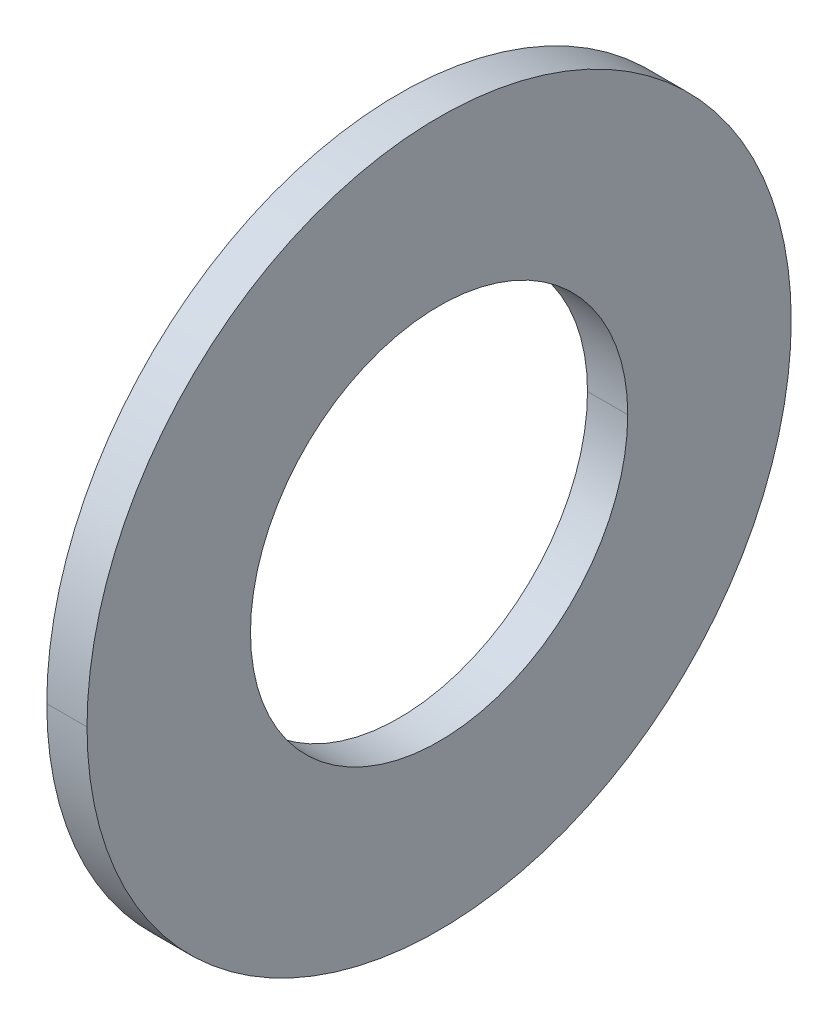
ISO-10303-21;
HEADER;
FILE_DESCRIPTION(('STEP AP214'),'2;1');
FILE_NAME('part.step','',(''),(''),'','','');
FILE_SCHEMA(('AUTOMOTIVE_DESIGN { 1 0 10303 214 1 1 1 1 }'));
ENDSEC;
DATA;
#1=APPLICATION_CONTEXT('core data for automotive mechanical design processes');
#2=APPLICATION_PROTOCOL_DEFINITION('international standard','automotive_design',2000,#1);
#3=PRODUCT_CONTEXT('',#1,'mechanical');
#4=PRODUCT('Part','Part','',(#3));
#5=PRODUCT_RELATED_PRODUCT_CATEGORY('part','',(#4));
#6=PRODUCT_DEFINITION_FORMATION('','',#4);
#7=PRODUCT_DEFINITION_CONTEXT('part definition',#1,'design');
#8=PRODUCT_DEFINITION('design','',#6,#7);
#9=PRODUCT_DEFINITION_SHAPE('','',#8);
#10=(LENGTH_UNIT() NAMED_UNIT(*) SI_UNIT(.MILLI.,.METRE.));
#11=(NAMED_UNIT(*) PLANE_ANGLE_UNIT() SI_UNIT($,.RADIAN.));
#12=(NAMED_UNIT(*) SI_UNIT($,.STERADIAN.) SOLID_ANGLE_UNIT());
#13=UNCERTAINTY_MEASURE_WITH_UNIT(LENGTH_MEASURE(1.E-05),#10,'distance_accuracy_value','');
#14=(GEOMETRIC_REPRESENTATION_CONTEXT(3) GLOBAL_UNCERTAINTY_ASSIGNED_CONTEXT((#13)) GLOBAL_UNIT_ASSIGNED_CONTEXT((#10,
#11,#12)) REPRESENTATION_CONTEXT('',''));
#15=CARTESIAN_POINT('',(0.,0.,0.));
#16=DIRECTION('',(0.,0.,1.));
#17=DIRECTION('',(1.,0.,0.));
#18=AXIS2_PLACEMENT_3D('',#15,#16,#17);
#19=CARTESIAN_POINT('',(0.8,0.,0.));
#20=DIRECTION('',(-1.,0.,0.));
#21=DIRECTION('',(0.,1.,0.));
#22=AXIS2_PLACEMENT_3D('',#19,#20,#21);
#23=CYLINDRICAL_SURFACE('',#22,7.5);
#24=DIRECTION('',(-1.,0.,0.));
#25=VECTOR('',#24,1.);
#26=CARTESIAN_POINT('',(0.8,0.,-7.5));
#27=LINE('',#26,#25);
#28=CARTESIAN_POINT('',(0.8,0.,-7.5));
#29=VERTEX_POINT('',#28);
#30=CARTESIAN_POINT('',(-0.8,0.,-7.5));
#31=VERTEX_POINT('',#30);
#32=EDGE_CURVE('E11',#29,#31,#27,.T.);
#33=ORIENTED_EDGE('',*,*,#32,.T.);
#34=CARTESIAN_POINT('',(-0.8,0.,0.));
#35=DIRECTION('',(1.,0.,0.));
#36=DIRECTION('',(0.,0.,-1.));
#37=AXIS2_PLACEMENT_3D('',#34,#35,#36);
#38=CIRCLE('',#37,7.5);
#39=CARTESIAN_POINT('',(-0.8,0.,7.5));
#40=VERTEX_POINT('',#39);
#41=EDGE_CURVE('E24',#40,#31,#38,.T.);
#42=ORIENTED_EDGE('',*,*,#41,.F.);
#43=DIRECTION('',(-1.,0.,0.));
#44=VECTOR('',#43,1.);
#45=CARTESIAN_POINT('',(0.8,0.,7.5));
#46=LINE('',#45,#44);
#47=CARTESIAN_POINT('',(0.8,0.,7.5));
#48=VERTEX_POINT('',#47);
#49=EDGE_CURVE('E93',#48,#40,#46,.T.);
#50=ORIENTED_EDGE('',*,*,#49,.F.);
#51=CARTESIAN_POINT('',(0.8,0.,0.));
#52=DIRECTION('',(1.,0.,0.));
#53=DIRECTION('',(0.,0.,-1.));
#54=AXIS2_PLACEMENT_3D('',#51,#52,#53);
#55=CIRCLE('',#54,7.5);
#56=EDGE_CURVE('E89',#48,#29,#55,.T.);
#57=ORIENTED_EDGE('',*,*,#56,.T.);
#58=EDGE_LOOP('',(#33,#42,#50,#57));
#59=FACE_BOUND('',#58,.T.);
#60=ADVANCED_FACE('F16',(#59),#23,.F.);
#61=CARTESIAN_POINT('',(0.8,0.,0.));
#62=DIRECTION('',(1.,0.,0.));
#63=DIRECTION('',(0.,0.,-1.));
#64=AXIS2_PLACEMENT_3D('',#61,#62,#63);
#65=PLANE('',#64);
#66=ORIENTED_EDGE('',*,*,#56,.F.);
#67=CARTESIAN_POINT('',(0.8,0.,0.));
#68=DIRECTION('',(1.,0.,0.));
#69=DIRECTION('',(0.,0.,-1.));
#70=AXIS2_PLACEMENT_3D('',#67,#68,#69);
#71=CIRCLE('',#70,7.5);
#72=EDGE_CURVE('E84',#29,#48,#71,.T.);
#73=ORIENTED_EDGE('',*,*,#72,.F.);
#74=EDGE_LOOP('',(#66,#73));
#75=FACE_BOUND('',#74,.T.);
#76=CARTESIAN_POINT('',(0.8,0.,0.));
#77=DIRECTION('',(1.,0.,0.));
#78=DIRECTION('',(0.,0.,-1.));
#79=AXIS2_PLACEMENT_3D('',#76,#77,#78);
#80=CIRCLE('',#79,14.);
#81=CARTESIAN_POINT('',(0.8,0.,-14.));
#82=VERTEX_POINT('',#81);
#83=CARTESIAN_POINT('',(0.8,0.,14.));
#84=VERTEX_POINT('',#83);
#85=EDGE_CURVE('E71',#82,#84,#80,.T.);
#86=ORIENTED_EDGE('',*,*,#85,.T.);
#87=CARTESIAN_POINT('',(0.8,0.,0.));
#88=DIRECTION('',(1.,0.,0.));
#89=DIRECTION('',(0.,0.,-1.));
#90=AXIS2_PLACEMENT_3D('',#87,#88,#89);
#91=CIRCLE('',#90,14.);
#92=EDGE_CURVE('E72',#84,#82,#91,.T.);
#93=ORIENTED_EDGE('',*,*,#92,.T.);
#94=EDGE_LOOP('',(#86,#93));
#95=FACE_BOUND('',#94,.T.);
#96=ADVANCED_FACE('F115',(#75,#95),#65,.T.);
#97=CARTESIAN_POINT('',(0.8,0.,0.));
#98=DIRECTION('',(-1.,0.,0.));
#99=DIRECTION('',(0.,1.,0.));
#100=AXIS2_PLACEMENT_3D('',#97,#98,#99);
#101=CYLINDRICAL_SURFACE('',#100,14.);
#102=DIRECTION('',(-1.,0.,0.));
#103=VECTOR('',#102,1.);
#104=CARTESIAN_POINT('',(0.8,0.,-14.));
#105=LINE('',#104,#103);
#106=CARTESIAN_POINT('',(-0.8,0.,-14.));
#107=VERTEX_POINT('',#106);
#108=EDGE_CURVE('E58',#82,#107,#105,.T.);
#109=ORIENTED_EDGE('',*,*,#108,.F.);
#110=ORIENTED_EDGE('',*,*,#92,.F.);
#111=DIRECTION('',(-1.,0.,0.));
#112=VECTOR('',#111,1.);
#113=CARTESIAN_POINT('',(0.8,0.,14.));
#114=LINE('',#113,#112);
#115=CARTESIAN_POINT('',(-0.8,0.,14.));
#116=VERTEX_POINT('',#115);
#117=EDGE_CURVE('E60',#84,#116,#114,.T.);
#118=ORIENTED_EDGE('',*,*,#117,.T.);
#119=CARTESIAN_POINT('',(-0.8,0.,0.));
#120=DIRECTION('',(1.,0.,0.));
#121=DIRECTION('',(0.,0.,-1.));
#122=AXIS2_PLACEMENT_3D('',#119,#120,#121);
#123=CIRCLE('',#122,14.);
#124=EDGE_CURVE('E53',#116,#107,#123,.T.);
#125=ORIENTED_EDGE('',*,*,#124,.T.);
#126=EDGE_LOOP('',(#109,#110,#118,#125));
#127=FACE_BOUND('',#126,.T.);
#128=ADVANCED_FACE('F55',(#127),#101,.T.);
#129=CARTESIAN_POINT('',(-0.8,0.,0.));
#130=DIRECTION('',(1.,0.,0.));
#131=DIRECTION('',(0.,0.,-1.));
#132=AXIS2_PLACEMENT_3D('',#129,#130,#131);
#133=PLANE('',#132);
#134=CARTESIAN_POINT('',(-0.8,0.,0.));
#135=DIRECTION('',(1.,0.,0.));
#136=DIRECTION('',(0.,0.,-1.));
#137=AXIS2_PLACEMENT_3D('',#134,#135,#136);
#138=CIRCLE('',#137,7.5);
#139=EDGE_CURVE('E63',#31,#40,#138,.T.);
#140=ORIENTED_EDGE('',*,*,#139,.T.);
#141=ORIENTED_EDGE('',*,*,#41,.T.);
#142=EDGE_LOOP('',(#140,#141));
#143=FACE_BOUND('',#142,.T.);
#144=ORIENTED_EDGE('',*,*,#124,.F.);
#145=CARTESIAN_POINT('',(-0.8,0.,0.));
#146=DIRECTION('',(1.,0.,0.));
#147=DIRECTION('',(0.,0.,-1.));
#148=AXIS2_PLACEMENT_3D('',#145,#146,#147);
#149=CIRCLE('',#148,14.);
#150=EDGE_CURVE('E65',#107,#116,#149,.T.);
#151=ORIENTED_EDGE('',*,*,#150,.F.);
#152=EDGE_LOOP('',(#144,#151));
#153=FACE_BOUND('',#152,.T.);
#154=ADVANCED_FACE('F66',(#143,#153),#133,.F.);
#155=CARTESIAN_POINT('',(0.8,0.,0.));
#156=DIRECTION('',(-1.,0.,0.));
#157=DIRECTION('',(0.,-1.,0.));
#158=AXIS2_PLACEMENT_3D('',#155,#156,#157);
#159=CYLINDRICAL_SURFACE('',#158,14.);
#160=ORIENTED_EDGE('',*,*,#108,.T.);
#161=ORIENTED_EDGE('',*,*,#150,.T.);
#162=ORIENTED_EDGE('',*,*,#117,.F.);
#163=ORIENTED_EDGE('',*,*,#85,.F.);
#164=EDGE_LOOP('',(#160,#161,#162,#163));
#165=FACE_BOUND('',#164,.T.);
#166=ADVANCED_FACE('F70',(#165),#159,.T.);
#167=CARTESIAN_POINT('',(0.8,0.,0.));
#168=DIRECTION('',(-1.,0.,0.));
#169=DIRECTION('',(0.,-1.,0.));
#170=AXIS2_PLACEMENT_3D('',#167,#168,#169);
#171=CYLINDRICAL_SURFACE('',#170,7.5);
#172=ORIENTED_EDGE('',*,*,#32,.F.);
#173=ORIENTED_EDGE('',*,*,#72,.T.);
#174=ORIENTED_EDGE('',*,*,#49,.T.);
#175=ORIENTED_EDGE('',*,*,#139,.F.);
#176=EDGE_LOOP('',(#172,#173,#174,#175));
#177=FACE_BOUND('',#176,.T.);
#178=ADVANCED_FACE('F111',(#177),#171,.F.);
#179=CLOSED_SHELL('',(#60,#96,#128,#154,#166,#178));
#180=MANIFOLD_SOLID_BREP('B1',#179);
#181=ADVANCED_BREP_SHAPE_REPRESENTATION('',(#18,#180),#14);
#182=SHAPE_DEFINITION_REPRESENTATION(#9,#181);
ENDSEC;
END-ISO-10303-21;
